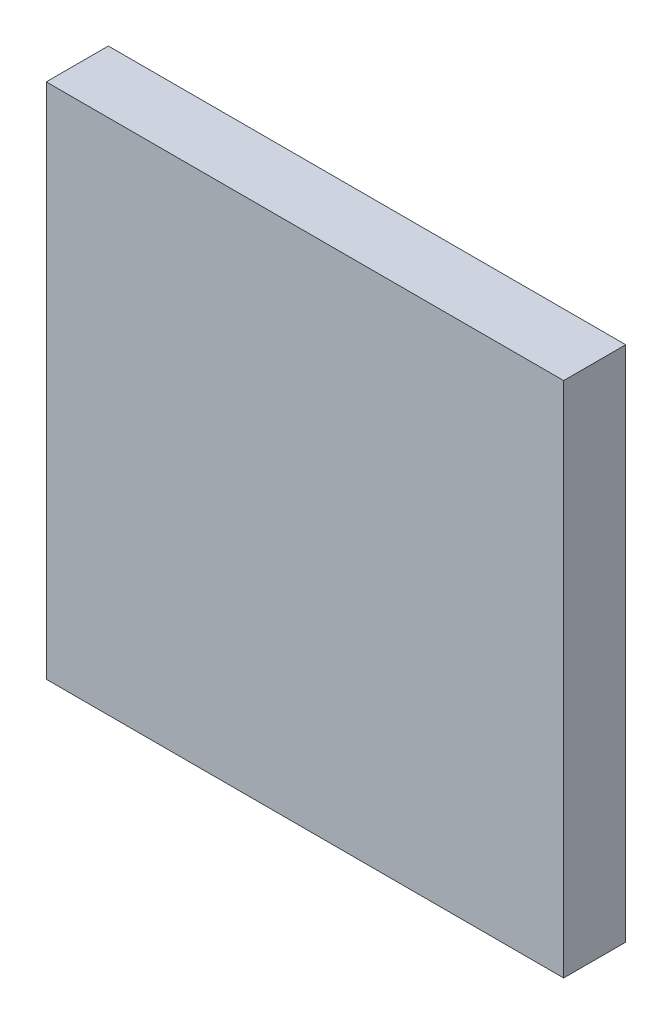
ISO-10303-21;
HEADER;
FILE_DESCRIPTION(('STEP AP214'),'2;1');
FILE_NAME('part.step','',(''),(''),'','','');
FILE_SCHEMA(('AUTOMOTIVE_DESIGN { 1 0 10303 214 1 1 1 1 }'));
ENDSEC;
DATA;
#1=APPLICATION_CONTEXT('core data for automotive mechanical design processes');
#2=APPLICATION_PROTOCOL_DEFINITION('international standard','automotive_design',2000,#1);
#3=PRODUCT_CONTEXT('',#1,'mechanical');
#4=PRODUCT('Part','Part','',(#3));
#5=PRODUCT_RELATED_PRODUCT_CATEGORY('part','',(#4));
#6=PRODUCT_DEFINITION_FORMATION('','',#4);
#7=PRODUCT_DEFINITION_CONTEXT('part definition',#1,'design');
#8=PRODUCT_DEFINITION('design','',#6,#7);
#9=PRODUCT_DEFINITION_SHAPE('','',#8);
#10=(LENGTH_UNIT() NAMED_UNIT(*) SI_UNIT(.MILLI.,.METRE.));
#11=(NAMED_UNIT(*) PLANE_ANGLE_UNIT() SI_UNIT($,.RADIAN.));
#12=(NAMED_UNIT(*) SI_UNIT($,.STERADIAN.) SOLID_ANGLE_UNIT());
#13=UNCERTAINTY_MEASURE_WITH_UNIT(LENGTH_MEASURE(1.E-05),#10,'distance_accuracy_value','');
#14=(GEOMETRIC_REPRESENTATION_CONTEXT(3) GLOBAL_UNCERTAINTY_ASSIGNED_CONTEXT((#13)) GLOBAL_UNIT_ASSIGNED_CONTEXT((#10,
#11,#12)) REPRESENTATION_CONTEXT('',''));
#15=CARTESIAN_POINT('',(0.,0.,0.));
#16=DIRECTION('',(0.,0.,1.));
#17=DIRECTION('',(1.,0.,0.));
#18=AXIS2_PLACEMENT_3D('',#15,#16,#17);
#19=CARTESIAN_POINT('',(-5.00000016,-5.00000016,1.20000014));
#20=DIRECTION('',(0.,0.,-1.));
#21=DIRECTION('',(-1.,0.,0.));
#22=AXIS2_PLACEMENT_3D('',#19,#20,#21);
#23=PLANE('',#22);
#24=DIRECTION('',(0.,1.,0.));
#25=VECTOR('',#24,1.);
#26=CARTESIAN_POINT('',(5.00000016,-5.00000016,1.20000014));
#27=LINE('',#26,#25);
#28=CARTESIAN_POINT('',(5.00000016,-5.00000016,1.20000014));
#29=VERTEX_POINT('',#28);
#30=CARTESIAN_POINT('',(5.00000016,5.00000016,1.20000014));
#31=VERTEX_POINT('',#30);
#32=EDGE_CURVE('E55',#29,#31,#27,.T.);
#33=ORIENTED_EDGE('',*,*,#32,.T.);
#34=DIRECTION('',(1.,0.,0.));
#35=VECTOR('',#34,1.);
#36=CARTESIAN_POINT('',(5.00000016,5.00000016,1.20000014));
#37=LINE('',#36,#35);
#38=CARTESIAN_POINT('',(-5.00000016,5.00000016,1.20000014));
#39=VERTEX_POINT('',#38);
#40=EDGE_CURVE('E57',#31,#39,#37,.F.);
#41=ORIENTED_EDGE('',*,*,#40,.T.);
#42=DIRECTION('',(0.,1.,0.));
#43=VECTOR('',#42,1.);
#44=CARTESIAN_POINT('',(-5.00000016,5.00000016,1.20000014));
#45=LINE('',#44,#43);
#46=CARTESIAN_POINT('',(-5.00000016,-5.00000016,1.20000014));
#47=VERTEX_POINT('',#46);
#48=EDGE_CURVE('E20',#39,#47,#45,.F.);
#49=ORIENTED_EDGE('',*,*,#48,.T.);
#50=DIRECTION('',(1.,0.,0.));
#51=VECTOR('',#50,1.);
#52=CARTESIAN_POINT('',(-5.00000016,-5.00000016,1.20000014));
#53=LINE('',#52,#51);
#54=EDGE_CURVE('E80',#47,#29,#53,.T.);
#55=ORIENTED_EDGE('',*,*,#54,.T.);
#56=EDGE_LOOP('',(#33,#41,#49,#55));
#57=FACE_BOUND('',#56,.T.);
#58=ADVANCED_FACE('F17',(#57),#23,.F.);
#59=CARTESIAN_POINT('',(-5.00000016,5.00000016,0.));
#60=DIRECTION('',(1.,0.,0.));
#61=DIRECTION('',(0.,0.,-1.));
#62=AXIS2_PLACEMENT_3D('',#59,#60,#61);
#63=PLANE('',#62);
#64=DIRECTION('',(0.,0.,1.));
#65=VECTOR('',#64,1.);
#66=CARTESIAN_POINT('',(-5.00000016,-5.00000016,0.));
#67=LINE('',#66,#65);
#68=CARTESIAN_POINT('',(-5.00000016,-5.00000016,0.));
#69=VERTEX_POINT('',#68);
#70=EDGE_CURVE('E68',#69,#47,#67,.T.);
#71=ORIENTED_EDGE('',*,*,#70,.T.);
#72=ORIENTED_EDGE('',*,*,#48,.F.);
#73=DIRECTION('',(0.,0.,-1.));
#74=VECTOR('',#73,1.);
#75=CARTESIAN_POINT('',(-5.00000016,5.00000016,0.));
#76=LINE('',#75,#74);
#77=CARTESIAN_POINT('',(-5.00000016,5.00000016,0.));
#78=VERTEX_POINT('',#77);
#79=EDGE_CURVE('E63',#39,#78,#76,.T.);
#80=ORIENTED_EDGE('',*,*,#79,.T.);
#81=DIRECTION('',(0.,1.,0.));
#82=VECTOR('',#81,1.);
#83=CARTESIAN_POINT('',(-5.00000016,-5.00000016,0.));
#84=LINE('',#83,#82);
#85=EDGE_CURVE('E83',#69,#78,#84,.T.);
#86=ORIENTED_EDGE('',*,*,#85,.F.);
#87=EDGE_LOOP('',(#71,#72,#80,#86));
#88=FACE_BOUND('',#87,.T.);
#89=ADVANCED_FACE('F65',(#88),#63,.F.);
#90=CARTESIAN_POINT('',(5.00000016,5.00000016,0.));
#91=DIRECTION('',(0.,-1.,0.));
#92=DIRECTION('',(0.,0.,-1.));
#93=AXIS2_PLACEMENT_3D('',#90,#91,#92);
#94=PLANE('',#93);
#95=ORIENTED_EDGE('',*,*,#79,.F.);
#96=ORIENTED_EDGE('',*,*,#40,.F.);
#97=DIRECTION('',(0.,0.,1.));
#98=VECTOR('',#97,1.);
#99=CARTESIAN_POINT('',(5.00000016,5.00000016,0.));
#100=LINE('',#99,#98);
#101=CARTESIAN_POINT('',(5.00000016,5.00000016,0.));
#102=VERTEX_POINT('',#101);
#103=EDGE_CURVE('E75',#31,#102,#100,.F.);
#104=ORIENTED_EDGE('',*,*,#103,.T.);
#105=DIRECTION('',(-1.,0.,0.));
#106=VECTOR('',#105,1.);
#107=CARTESIAN_POINT('',(-5.00000016,5.00000016,0.));
#108=LINE('',#107,#106);
#109=EDGE_CURVE('E72',#78,#102,#108,.F.);
#110=ORIENTED_EDGE('',*,*,#109,.F.);
#111=EDGE_LOOP('',(#95,#96,#104,#110));
#112=FACE_BOUND('',#111,.T.);
#113=ADVANCED_FACE('F70',(#112),#94,.F.);
#114=CARTESIAN_POINT('',(5.00000016,-5.00000016,0.));
#115=DIRECTION('',(-1.,0.,0.));
#116=DIRECTION('',(0.,0.,1.));
#117=AXIS2_PLACEMENT_3D('',#114,#115,#116);
#118=PLANE('',#117);
#119=ORIENTED_EDGE('',*,*,#103,.F.);
#120=ORIENTED_EDGE('',*,*,#32,.F.);
#121=DIRECTION('',(0.,0.,1.));
#122=VECTOR('',#121,1.);
#123=CARTESIAN_POINT('',(5.00000016,-5.00000016,0.));
#124=LINE('',#123,#122);
#125=CARTESIAN_POINT('',(5.00000016,-5.00000016,0.));
#126=VERTEX_POINT('',#125);
#127=EDGE_CURVE('E35',#29,#126,#124,.F.);
#128=ORIENTED_EDGE('',*,*,#127,.T.);
#129=DIRECTION('',(0.,1.,0.));
#130=VECTOR('',#129,1.);
#131=CARTESIAN_POINT('',(5.00000016,-5.00000016,0.));
#132=LINE('',#131,#130);
#133=EDGE_CURVE('E26',#102,#126,#132,.F.);
#134=ORIENTED_EDGE('',*,*,#133,.F.);
#135=EDGE_LOOP('',(#119,#120,#128,#134));
#136=FACE_BOUND('',#135,.T.);
#137=ADVANCED_FACE('F89',(#136),#118,.F.);
#138=CARTESIAN_POINT('',(-5.00000016,-5.00000016,0.));
#139=DIRECTION('',(0.,1.,0.));
#140=DIRECTION('',(0.,0.,1.));
#141=AXIS2_PLACEMENT_3D('',#138,#139,#140);
#142=PLANE('',#141);
#143=ORIENTED_EDGE('',*,*,#127,.F.);
#144=ORIENTED_EDGE('',*,*,#54,.F.);
#145=ORIENTED_EDGE('',*,*,#70,.F.);
#146=DIRECTION('',(-1.,0.,0.));
#147=VECTOR('',#146,1.);
#148=CARTESIAN_POINT('',(-5.00000016,-5.00000016,0.));
#149=LINE('',#148,#147);
#150=EDGE_CURVE('E11',#126,#69,#149,.T.);
#151=ORIENTED_EDGE('',*,*,#150,.F.);
#152=EDGE_LOOP('',(#143,#144,#145,#151));
#153=FACE_BOUND('',#152,.T.);
#154=ADVANCED_FACE('F91',(#153),#142,.F.);
#155=CARTESIAN_POINT('',(-5.00000016,-5.00000016,0.));
#156=DIRECTION('',(0.,0.,-1.));
#157=DIRECTION('',(-1.,0.,0.));
#158=AXIS2_PLACEMENT_3D('',#155,#156,#157);
#159=PLANE('',#158);
#160=ORIENTED_EDGE('',*,*,#133,.T.);
#161=ORIENTED_EDGE('',*,*,#150,.T.);
#162=ORIENTED_EDGE('',*,*,#85,.T.);
#163=ORIENTED_EDGE('',*,*,#109,.T.);
#164=EDGE_LOOP('',(#160,#161,#162,#163));
#165=FACE_BOUND('',#164,.T.);
#166=ADVANCED_FACE('F88',(#165),#159,.T.);
#167=CLOSED_SHELL('',(#58,#89,#113,#137,#154,#166));
#168=MANIFOLD_SOLID_BREP('B1',#167);
#169=ADVANCED_BREP_SHAPE_REPRESENTATION('',(#18,#168),#14);
#170=SHAPE_DEFINITION_REPRESENTATION(#9,#169);
ENDSEC;
END-ISO-10303-21;
